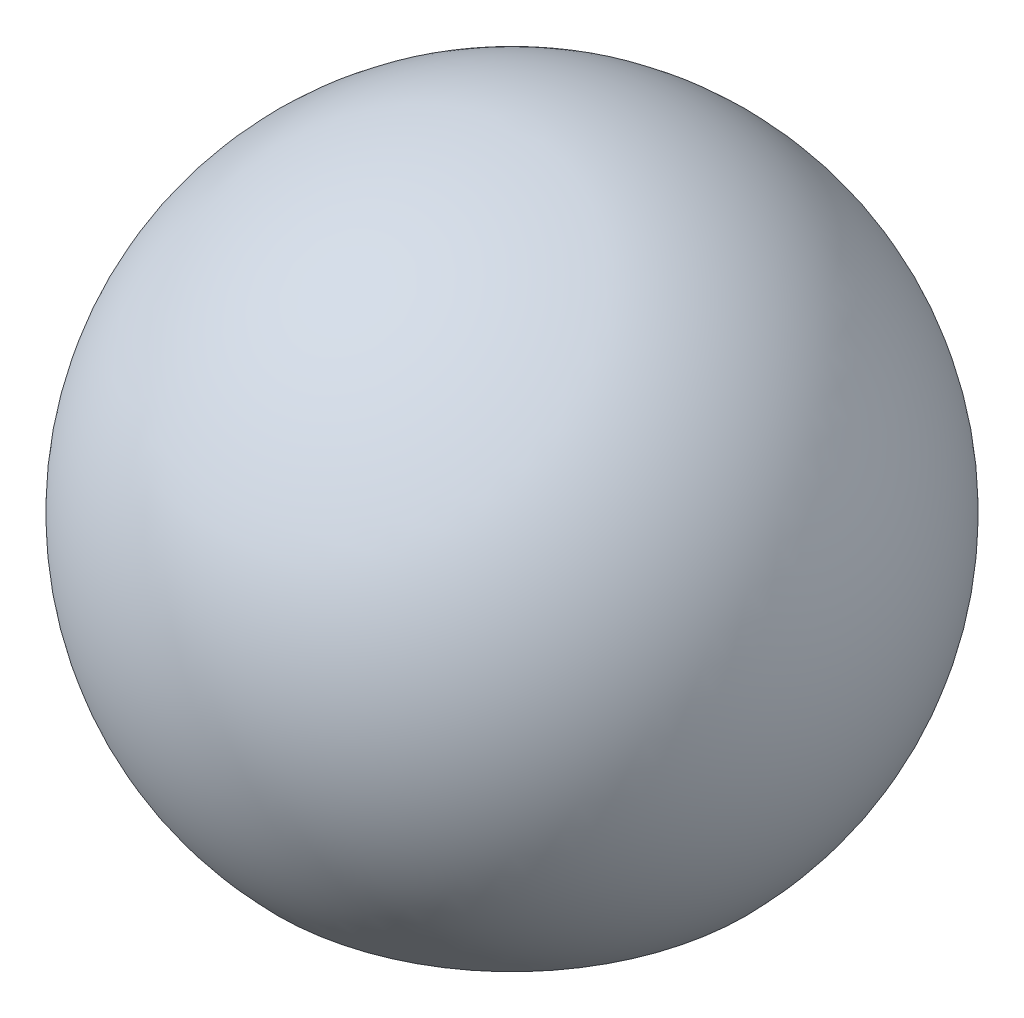
ISO-10303-21;
HEADER;
FILE_DESCRIPTION(('STEP AP214'),'2;1');
FILE_NAME('part.step','',(''),(''),'','','');
FILE_SCHEMA(('AUTOMOTIVE_DESIGN { 1 0 10303 214 1 1 1 1 }'));
ENDSEC;
DATA;
#1=APPLICATION_CONTEXT('core data for automotive mechanical design processes');
#2=APPLICATION_PROTOCOL_DEFINITION('international standard','automotive_design',2000,#1);
#3=PRODUCT_CONTEXT('',#1,'mechanical');
#4=PRODUCT('Part','Part','',(#3));
#5=PRODUCT_RELATED_PRODUCT_CATEGORY('part','',(#4));
#6=PRODUCT_DEFINITION_FORMATION('','',#4);
#7=PRODUCT_DEFINITION_CONTEXT('part definition',#1,'design');
#8=PRODUCT_DEFINITION('design','',#6,#7);
#9=PRODUCT_DEFINITION_SHAPE('','',#8);
#10=(LENGTH_UNIT() NAMED_UNIT(*) SI_UNIT(.MILLI.,.METRE.));
#11=(NAMED_UNIT(*) PLANE_ANGLE_UNIT() SI_UNIT($,.RADIAN.));
#12=(NAMED_UNIT(*) SI_UNIT($,.STERADIAN.) SOLID_ANGLE_UNIT());
#13=UNCERTAINTY_MEASURE_WITH_UNIT(LENGTH_MEASURE(1.E-05),#10,'distance_accuracy_value','');
#14=(GEOMETRIC_REPRESENTATION_CONTEXT(3) GLOBAL_UNCERTAINTY_ASSIGNED_CONTEXT((#13)) GLOBAL_UNIT_ASSIGNED_CONTEXT((#10,
#11,#12)) REPRESENTATION_CONTEXT('',''));
#15=CARTESIAN_POINT('',(0.,0.,0.));
#16=DIRECTION('',(0.,0.,1.));
#17=DIRECTION('',(1.,0.,0.));
#18=AXIS2_PLACEMENT_3D('',#15,#16,#17);
#19=CARTESIAN_POINT('',(0.,500.,0.));
#20=DIRECTION('',(0.,1.,0.));
#21=DIRECTION('',(1.,0.,0.));
#22=AXIS2_PLACEMENT_3D('',#19,#20,#21);
#23=SPHERICAL_SURFACE('',#22,600.);
#24=CARTESIAN_POINT('',(0.,77.7375623164778,0.));
#25=DIRECTION('',(0.,1.,0.));
#26=DIRECTION('',(0.,0.,1.));
#27=AXIS2_PLACEMENT_3D('',#24,#25,#26);
#28=CIRCLE('',#27,426.256300506596);
#29=CARTESIAN_POINT('',(0.,77.7375623164778,426.256300506596));
#30=VERTEX_POINT('',#29);
#31=EDGE_CURVE('E52',#30,#30,#28,.T.);
#32=ORIENTED_EDGE('',*,*,#31,.T.);
#33=EDGE_LOOP('',(#32));
#34=FACE_BOUND('',#33,.T.);
#35=ADVANCED_FACE('F45',(#34),#23,.T.);
#36=CARTESIAN_POINT('',(0.,500.,0.));
#37=DIRECTION('',(0.,1.,0.));
#38=DIRECTION('',(1.,0.,0.));
#39=AXIS2_PLACEMENT_3D('',#36,#37,#38);
#40=SPHERICAL_SURFACE('',#39,400.);
#41=CARTESIAN_POINT('',(0.,218.491708210985,0.));
#42=DIRECTION('',(0.,1.,0.));
#43=DIRECTION('',(0.,0.,1.));
#44=AXIS2_PLACEMENT_3D('',#41,#42,#43);
#45=CIRCLE('',#44,284.170867004397);
#46=CARTESIAN_POINT('',(0.,218.491708210985,284.170867004397));
#47=VERTEX_POINT('',#46);
#48=EDGE_CURVE('E10',#47,#47,#45,.T.);
#49=ORIENTED_EDGE('',*,*,#48,.F.);
#50=EDGE_LOOP('',(#49));
#51=FACE_BOUND('',#50,.T.);
#52=ADVANCED_FACE('F62',(#51),#40,.F.);
#53=CARTESIAN_POINT('',(0.,218.491708210985,0.));
#54=DIRECTION('',(0.,-1.,0.));
#55=DIRECTION('',(0.,0.,-1.));
#56=AXIS2_PLACEMENT_3D('',#53,#54,#55);
#57=CONICAL_SURFACE('',#56,284.170867004397,0.790104993252348);
#58=ORIENTED_EDGE('',*,*,#31,.F.);
#59=EDGE_LOOP('',(#58));
#60=FACE_BOUND('',#59,.T.);
#61=ORIENTED_EDGE('',*,*,#48,.T.);
#62=EDGE_LOOP('',(#61));
#63=FACE_BOUND('',#62,.T.);
#64=ADVANCED_FACE('F60',(#60,#63),#57,.F.);
#65=CLOSED_SHELL('',(#35,#52,#64));
#66=MANIFOLD_SOLID_BREP('B2',#65);
#67=ADVANCED_BREP_SHAPE_REPRESENTATION('',(#18,#66),#14);
#68=SHAPE_DEFINITION_REPRESENTATION(#9,#67);
ENDSEC;
END-ISO-10303-21;
